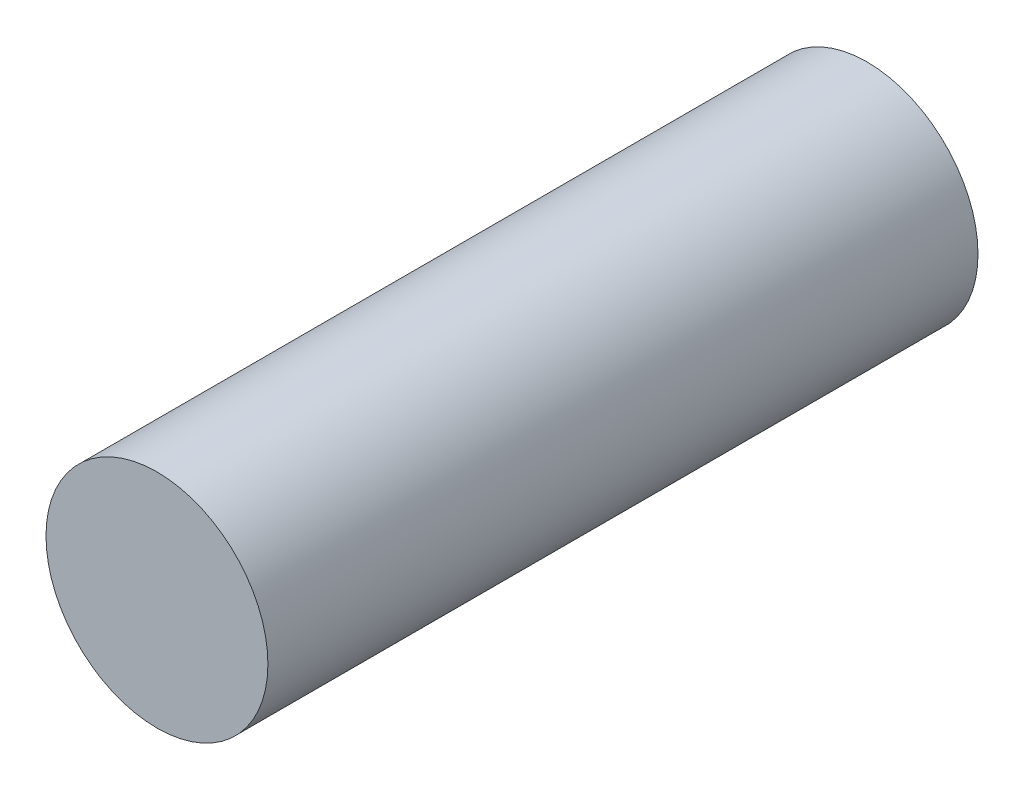
ISO-10303-21;
HEADER;
FILE_DESCRIPTION(('STEP AP214'),'2;1');
FILE_NAME('part.step','',(''),(''),'','','');
FILE_SCHEMA(('AUTOMOTIVE_DESIGN { 1 0 10303 214 1 1 1 1 }'));
ENDSEC;
DATA;
#1=APPLICATION_CONTEXT('core data for automotive mechanical design processes');
#2=APPLICATION_PROTOCOL_DEFINITION('international standard','automotive_design',2000,#1);
#3=PRODUCT_CONTEXT('',#1,'mechanical');
#4=PRODUCT('Part','Part','',(#3));
#5=PRODUCT_RELATED_PRODUCT_CATEGORY('part','',(#4));
#6=PRODUCT_DEFINITION_FORMATION('','',#4);
#7=PRODUCT_DEFINITION_CONTEXT('part definition',#1,'design');
#8=PRODUCT_DEFINITION('design','',#6,#7);
#9=PRODUCT_DEFINITION_SHAPE('','',#8);
#10=(LENGTH_UNIT() NAMED_UNIT(*) SI_UNIT(.MILLI.,.METRE.));
#11=(NAMED_UNIT(*) PLANE_ANGLE_UNIT() SI_UNIT($,.RADIAN.));
#12=(NAMED_UNIT(*) SI_UNIT($,.STERADIAN.) SOLID_ANGLE_UNIT());
#13=UNCERTAINTY_MEASURE_WITH_UNIT(LENGTH_MEASURE(1.E-05),#10,'distance_accuracy_value','');
#14=(GEOMETRIC_REPRESENTATION_CONTEXT(3) GLOBAL_UNCERTAINTY_ASSIGNED_CONTEXT((#13)) GLOBAL_UNIT_ASSIGNED_CONTEXT((#10,
#11,#12)) REPRESENTATION_CONTEXT('',''));
#15=CARTESIAN_POINT('',(0.,0.,0.));
#16=DIRECTION('',(0.,0.,1.));
#17=DIRECTION('',(1.,0.,0.));
#18=AXIS2_PLACEMENT_3D('',#15,#16,#17);
#19=CARTESIAN_POINT('',(0.,0.,40.));
#20=DIRECTION('',(0.,0.,-1.));
#21=DIRECTION('',(-1.,0.,0.));
#22=AXIS2_PLACEMENT_3D('',#19,#20,#21);
#23=CYLINDRICAL_SURFACE('',#22,6.25);
#24=CARTESIAN_POINT('',(0.,0.,40.));
#25=DIRECTION('',(0.,0.,1.));
#26=DIRECTION('',(1.,0.,0.));
#27=AXIS2_PLACEMENT_3D('',#24,#25,#26);
#28=CIRCLE('',#27,6.25);
#29=CARTESIAN_POINT('',(6.25,0.,40.));
#30=VERTEX_POINT('',#29);
#31=EDGE_CURVE('E10',#30,#30,#28,.T.);
#32=ORIENTED_EDGE('',*,*,#31,.F.);
#33=EDGE_LOOP('',(#32));
#34=FACE_BOUND('',#33,.T.);
#35=CARTESIAN_POINT('',(0.,0.,0.));
#36=DIRECTION('',(0.,0.,1.));
#37=DIRECTION('',(1.,0.,0.));
#38=AXIS2_PLACEMENT_3D('',#35,#36,#37);
#39=CIRCLE('',#38,6.25);
#40=CARTESIAN_POINT('',(6.25,0.,0.));
#41=VERTEX_POINT('',#40);
#42=EDGE_CURVE('E36',#41,#41,#39,.T.);
#43=ORIENTED_EDGE('',*,*,#42,.T.);
#44=EDGE_LOOP('',(#43));
#45=FACE_BOUND('',#44,.T.);
#46=ADVANCED_FACE('F33',(#34,#45),#23,.T.);
#47=CARTESIAN_POINT('',(0.,0.,40.));
#48=DIRECTION('',(0.,0.,1.));
#49=DIRECTION('',(1.,0.,0.));
#50=AXIS2_PLACEMENT_3D('',#47,#48,#49);
#51=PLANE('',#50);
#52=ORIENTED_EDGE('',*,*,#31,.T.);
#53=EDGE_LOOP('',(#52));
#54=FACE_BOUND('',#53,.T.);
#55=ADVANCED_FACE('F48',(#54),#51,.T.);
#56=CARTESIAN_POINT('',(0.,0.,0.));
#57=DIRECTION('',(0.,0.,1.));
#58=DIRECTION('',(1.,0.,0.));
#59=AXIS2_PLACEMENT_3D('',#56,#57,#58);
#60=PLANE('',#59);
#61=ORIENTED_EDGE('',*,*,#42,.F.);
#62=EDGE_LOOP('',(#61));
#63=FACE_BOUND('',#62,.T.);
#64=ADVANCED_FACE('F46',(#63),#60,.F.);
#65=CLOSED_SHELL('',(#46,#55,#64));
#66=MANIFOLD_SOLID_BREP('B2',#65);
#67=ADVANCED_BREP_SHAPE_REPRESENTATION('',(#18,#66),#14);
#68=SHAPE_DEFINITION_REPRESENTATION(#9,#67);
ENDSEC;
END-ISO-10303-21;
